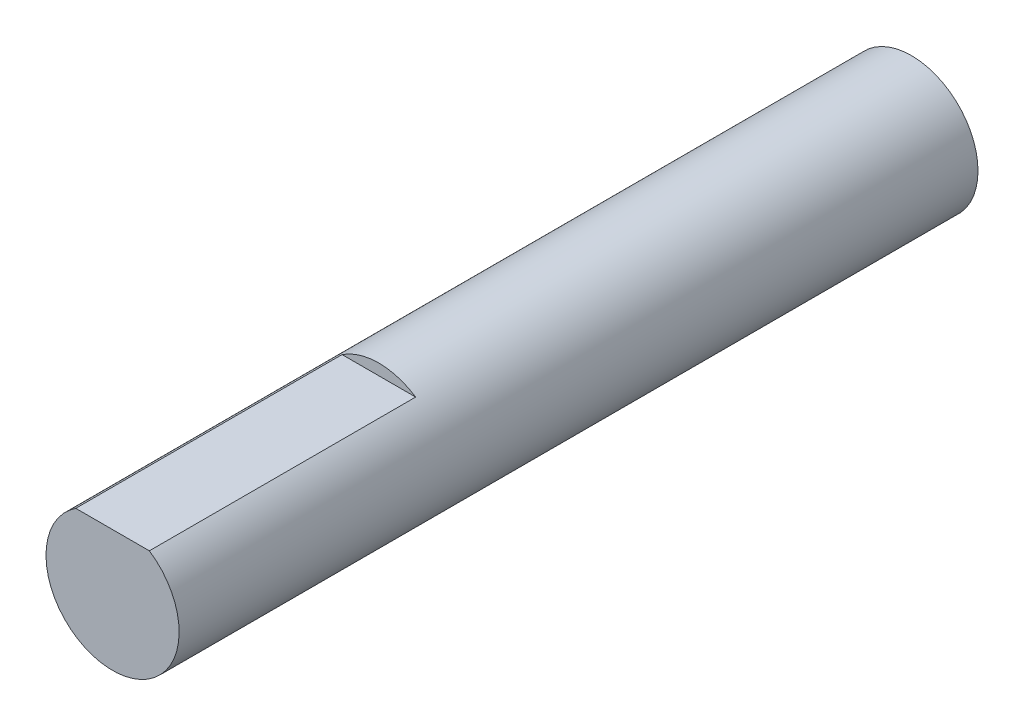
ISO-10303-21;
HEADER;
FILE_DESCRIPTION(('STEP AP214'),'2;1');
FILE_NAME('part.step','',(''),(''),'','','');
FILE_SCHEMA(('AUTOMOTIVE_DESIGN { 1 0 10303 214 1 1 1 1 }'));
ENDSEC;
DATA;
#1=APPLICATION_CONTEXT('core data for automotive mechanical design processes');
#2=APPLICATION_PROTOCOL_DEFINITION('international standard','automotive_design',2000,#1);
#3=PRODUCT_CONTEXT('',#1,'mechanical');
#4=PRODUCT('Part','Part','',(#3));
#5=PRODUCT_RELATED_PRODUCT_CATEGORY('part','',(#4));
#6=PRODUCT_DEFINITION_FORMATION('','',#4);
#7=PRODUCT_DEFINITION_CONTEXT('part definition',#1,'design');
#8=PRODUCT_DEFINITION('design','',#6,#7);
#9=PRODUCT_DEFINITION_SHAPE('','',#8);
#10=(LENGTH_UNIT() NAMED_UNIT(*) SI_UNIT(.MILLI.,.METRE.));
#11=(NAMED_UNIT(*) PLANE_ANGLE_UNIT() SI_UNIT($,.RADIAN.));
#12=(NAMED_UNIT(*) SI_UNIT($,.STERADIAN.) SOLID_ANGLE_UNIT());
#13=UNCERTAINTY_MEASURE_WITH_UNIT(LENGTH_MEASURE(1.E-05),#10,'distance_accuracy_value','');
#14=(GEOMETRIC_REPRESENTATION_CONTEXT(3) GLOBAL_UNCERTAINTY_ASSIGNED_CONTEXT((#13)) GLOBAL_UNIT_ASSIGNED_CONTEXT((#10,
#11,#12)) REPRESENTATION_CONTEXT('',''));
#15=CARTESIAN_POINT('',(0.,0.,0.));
#16=DIRECTION('',(0.,0.,1.));
#17=DIRECTION('',(1.,0.,0.));
#18=AXIS2_PLACEMENT_3D('',#15,#16,#17);
#19=CARTESIAN_POINT('',(0.,0.,36.));
#20=DIRECTION('',(0.,0.,-1.));
#21=DIRECTION('',(-1.,0.,0.));
#22=AXIS2_PLACEMENT_3D('',#19,#20,#21);
#23=CYLINDRICAL_SURFACE('',#22,3.);
#24=CARTESIAN_POINT('',(0.,0.,36.));
#25=DIRECTION('',(0.,0.,1.));
#26=DIRECTION('',(1.,0.,0.));
#27=AXIS2_PLACEMENT_3D('',#24,#25,#26);
#28=CIRCLE('',#27,3.);
#29=CARTESIAN_POINT('',(-1.6583123951777,2.5,36.));
#30=VERTEX_POINT('',#29);
#31=CARTESIAN_POINT('',(1.6583123951777,2.5,36.));
#32=VERTEX_POINT('',#31);
#33=EDGE_CURVE('E11',#30,#32,#28,.T.);
#34=ORIENTED_EDGE('',*,*,#33,.F.);
#35=DIRECTION('',(0.,0.,1.));
#36=VECTOR('',#35,1.);
#37=CARTESIAN_POINT('',(-1.6583123951777,2.5,24.));
#38=LINE('',#37,#36);
#39=CARTESIAN_POINT('',(-1.6583123951777,2.5,24.));
#40=VERTEX_POINT('',#39);
#41=EDGE_CURVE('E49',#40,#30,#38,.T.);
#42=ORIENTED_EDGE('',*,*,#41,.F.);
#43=CARTESIAN_POINT('',(0.,0.,24.));
#44=DIRECTION('',(0.,0.,1.));
#45=DIRECTION('',(1.,0.,0.));
#46=AXIS2_PLACEMENT_3D('',#43,#44,#45);
#47=CIRCLE('',#46,3.);
#48=CARTESIAN_POINT('',(1.6583123951777,2.5,24.));
#49=VERTEX_POINT('',#48);
#50=EDGE_CURVE('E64',#49,#40,#47,.T.);
#51=ORIENTED_EDGE('',*,*,#50,.F.);
#52=DIRECTION('',(0.,0.,1.));
#53=VECTOR('',#52,1.);
#54=CARTESIAN_POINT('',(1.6583123951777,2.5,24.));
#55=LINE('',#54,#53);
#56=EDGE_CURVE('E55',#49,#32,#55,.T.);
#57=ORIENTED_EDGE('',*,*,#56,.T.);
#58=EDGE_LOOP('',(#34,#42,#51,#57));
#59=FACE_BOUND('',#58,.T.);
#60=CARTESIAN_POINT('',(0.,0.,0.));
#61=DIRECTION('',(0.,0.,1.));
#62=DIRECTION('',(1.,0.,0.));
#63=AXIS2_PLACEMENT_3D('',#60,#61,#62);
#64=CIRCLE('',#63,3.);
#65=CARTESIAN_POINT('',(3.,0.,0.));
#66=VERTEX_POINT('',#65);
#67=EDGE_CURVE('E38',#66,#66,#64,.T.);
#68=ORIENTED_EDGE('',*,*,#67,.T.);
#69=EDGE_LOOP('',(#68));
#70=FACE_BOUND('',#69,.T.);
#71=ADVANCED_FACE('F35',(#59,#70),#23,.T.);
#72=CARTESIAN_POINT('',(0.,0.,36.));
#73=DIRECTION('',(0.,0.,1.));
#74=DIRECTION('',(1.,0.,0.));
#75=AXIS2_PLACEMENT_3D('',#72,#73,#74);
#76=PLANE('',#75);
#77=DIRECTION('',(1.,0.,0.));
#78=VECTOR('',#77,1.);
#79=CARTESIAN_POINT('',(-1.6583123951777,2.5,36.));
#80=LINE('',#79,#78);
#81=EDGE_CURVE('E60',#30,#32,#80,.T.);
#82=ORIENTED_EDGE('',*,*,#81,.F.);
#83=ORIENTED_EDGE('',*,*,#33,.T.);
#84=EDGE_LOOP('',(#82,#83));
#85=FACE_BOUND('',#84,.T.);
#86=ADVANCED_FACE('F70',(#85),#76,.T.);
#87=CARTESIAN_POINT('',(0.,0.,0.));
#88=DIRECTION('',(0.,0.,1.));
#89=DIRECTION('',(1.,0.,0.));
#90=AXIS2_PLACEMENT_3D('',#87,#88,#89);
#91=PLANE('',#90);
#92=ORIENTED_EDGE('',*,*,#67,.F.);
#93=EDGE_LOOP('',(#92));
#94=FACE_BOUND('',#93,.T.);
#95=ADVANCED_FACE('F72',(#94),#91,.F.);
#96=CARTESIAN_POINT('',(-1.6583123951777,2.5,24.));
#97=DIRECTION('',(0.,-1.,0.));
#98=DIRECTION('',(0.,0.,-1.));
#99=AXIS2_PLACEMENT_3D('',#96,#97,#98);
#100=PLANE('',#99);
#101=ORIENTED_EDGE('',*,*,#81,.T.);
#102=ORIENTED_EDGE('',*,*,#56,.F.);
#103=DIRECTION('',(1.,0.,0.));
#104=VECTOR('',#103,1.);
#105=CARTESIAN_POINT('',(-1.6583123951777,2.5,24.));
#106=LINE('',#105,#104);
#107=EDGE_CURVE('E87',#40,#49,#106,.T.);
#108=ORIENTED_EDGE('',*,*,#107,.F.);
#109=ORIENTED_EDGE('',*,*,#41,.T.);
#110=EDGE_LOOP('',(#101,#102,#108,#109));
#111=FACE_BOUND('',#110,.T.);
#112=ADVANCED_FACE('F61',(#111),#100,.F.);
#113=CARTESIAN_POINT('',(0.,0.,24.));
#114=DIRECTION('',(0.,0.,1.));
#115=DIRECTION('',(1.,0.,0.));
#116=AXIS2_PLACEMENT_3D('',#113,#114,#115);
#117=PLANE('',#116);
#118=ORIENTED_EDGE('',*,*,#50,.T.);
#119=ORIENTED_EDGE('',*,*,#107,.T.);
#120=EDGE_LOOP('',(#118,#119));
#121=FACE_BOUND('',#120,.T.);
#122=ADVANCED_FACE('F82',(#121),#117,.T.);
#123=CLOSED_SHELL('',(#71,#86,#95,#112,#122));
#124=MANIFOLD_SOLID_BREP('B2',#123);
#125=ADVANCED_BREP_SHAPE_REPRESENTATION('',(#18,#124),#14);
#126=SHAPE_DEFINITION_REPRESENTATION(#9,#125);
ENDSEC;
END-ISO-10303-21;
